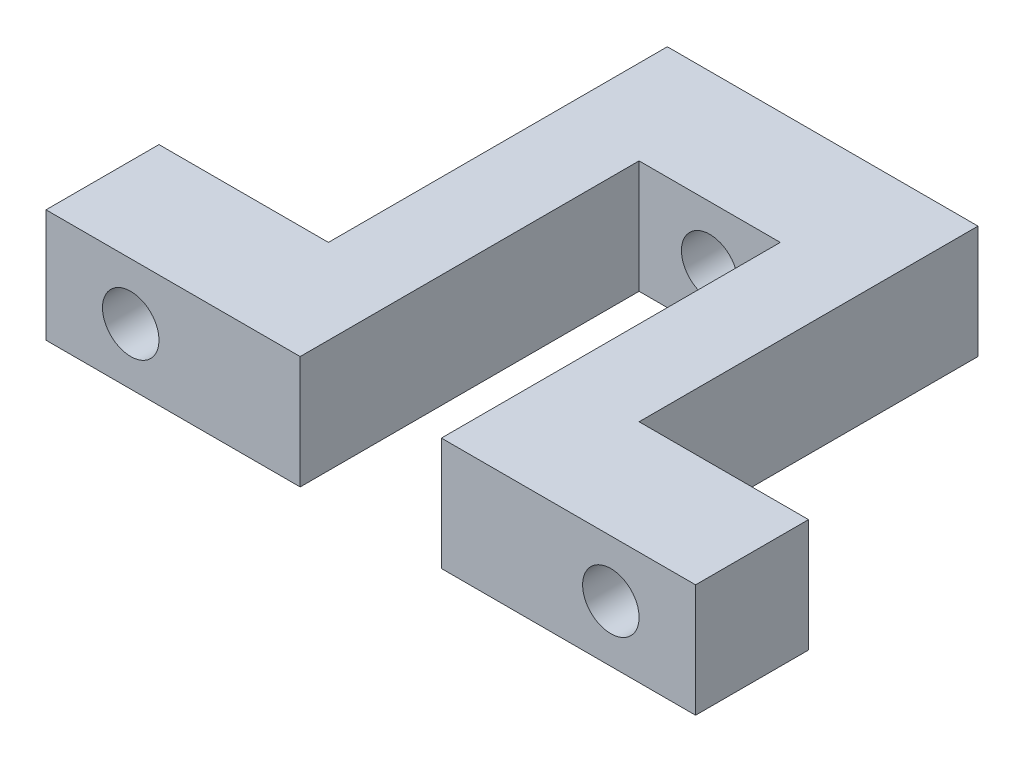
ISO-10303-21;
HEADER;
FILE_DESCRIPTION(('STEP AP214'),'2;1');
FILE_NAME('part.step','',(''),(''),'','','');
FILE_SCHEMA(('AUTOMOTIVE_DESIGN { 1 0 10303 214 1 1 1 1 }'));
ENDSEC;
DATA;
#1=APPLICATION_CONTEXT('core data for automotive mechanical design processes');
#2=APPLICATION_PROTOCOL_DEFINITION('international standard','automotive_design',2000,#1);
#3=PRODUCT_CONTEXT('',#1,'mechanical');
#4=PRODUCT('Part','Part','',(#3));
#5=PRODUCT_RELATED_PRODUCT_CATEGORY('part','',(#4));
#6=PRODUCT_DEFINITION_FORMATION('','',#4);
#7=PRODUCT_DEFINITION_CONTEXT('part definition',#1,'design');
#8=PRODUCT_DEFINITION('design','',#6,#7);
#9=PRODUCT_DEFINITION_SHAPE('','',#8);
#10=(LENGTH_UNIT() NAMED_UNIT(*) SI_UNIT(.MILLI.,.METRE.));
#11=(NAMED_UNIT(*) PLANE_ANGLE_UNIT() SI_UNIT($,.RADIAN.));
#12=(NAMED_UNIT(*) SI_UNIT($,.STERADIAN.) SOLID_ANGLE_UNIT());
#13=UNCERTAINTY_MEASURE_WITH_UNIT(LENGTH_MEASURE(1.E-05),#10,'distance_accuracy_value','');
#14=(GEOMETRIC_REPRESENTATION_CONTEXT(3) GLOBAL_UNCERTAINTY_ASSIGNED_CONTEXT((#13)) GLOBAL_UNIT_ASSIGNED_CONTEXT((#10,
#11,#12)) REPRESENTATION_CONTEXT('',''));
#15=CARTESIAN_POINT('',(0.,0.,0.));
#16=DIRECTION('',(0.,0.,1.));
#17=DIRECTION('',(1.,0.,0.));
#18=AXIS2_PLACEMENT_3D('',#15,#16,#17);
#19=CARTESIAN_POINT('',(-25.,20.,38.8484446347032));
#20=DIRECTION('',(0.,0.,-1.));
#21=DIRECTION('',(-1.,0.,0.));
#22=AXIS2_PLACEMENT_3D('',#19,#20,#21);
#23=PLANE('',#22);
#24=CARTESIAN_POINT('',(-55.,10.,38.8484446347032));
#25=DIRECTION('',(0.,0.,-1.));
#26=DIRECTION('',(-1.,0.,0.));
#27=AXIS2_PLACEMENT_3D('',#24,#25,#26);
#28=CIRCLE('',#27,4.99999999999999);
#29=CARTESIAN_POINT('',(-60.,10.,38.8484446347032));
#30=VERTEX_POINT('',#29);
#31=EDGE_CURVE('E261',#30,#30,#28,.T.);
#32=ORIENTED_EDGE('',*,*,#31,.T.);
#33=EDGE_LOOP('',(#32));
#34=FACE_BOUND('',#33,.T.);
#35=DIRECTION('',(1.,0.,0.));
#36=VECTOR('',#35,1.);
#37=CARTESIAN_POINT('',(-25.,0.,38.8484446347032));
#38=LINE('',#37,#36);
#39=CARTESIAN_POINT('',(-70.,0.,38.8484446347032));
#40=VERTEX_POINT('',#39);
#41=CARTESIAN_POINT('',(-25.,0.,38.8484446347032));
#42=VERTEX_POINT('',#41);
#43=EDGE_CURVE('E152',#40,#42,#38,.T.);
#44=ORIENTED_EDGE('',*,*,#43,.T.);
#45=DIRECTION('',(0.,-1.,0.));
#46=VECTOR('',#45,1.);
#47=CARTESIAN_POINT('',(-25.,20.,38.8484446347032));
#48=LINE('',#47,#46);
#49=CARTESIAN_POINT('',(-25.,20.,38.8484446347032));
#50=VERTEX_POINT('',#49);
#51=EDGE_CURVE('E11',#50,#42,#48,.T.);
#52=ORIENTED_EDGE('',*,*,#51,.F.);
#53=DIRECTION('',(1.,0.,0.));
#54=VECTOR('',#53,1.);
#55=CARTESIAN_POINT('',(-25.,20.,38.8484446347032));
#56=LINE('',#55,#54);
#57=CARTESIAN_POINT('',(-70.,20.,38.8484446347032));
#58=VERTEX_POINT('',#57);
#59=EDGE_CURVE('E175',#58,#50,#56,.T.);
#60=ORIENTED_EDGE('',*,*,#59,.F.);
#61=DIRECTION('',(0.,-1.,0.));
#62=VECTOR('',#61,1.);
#63=CARTESIAN_POINT('',(-70.,20.,38.8484446347032));
#64=LINE('',#63,#62);
#65=EDGE_CURVE('E148',#58,#40,#64,.T.);
#66=ORIENTED_EDGE('',*,*,#65,.T.);
#67=EDGE_LOOP('',(#44,#52,#60,#66));
#68=FACE_BOUND('',#67,.T.);
#69=ADVANCED_FACE('F32',(#34,#68),#23,.F.);
#70=CARTESIAN_POINT('',(-25.,20.,-21.1515553652968));
#71=DIRECTION('',(-1.,0.,0.));
#72=DIRECTION('',(0.,0.,1.));
#73=AXIS2_PLACEMENT_3D('',#70,#71,#72);
#74=PLANE('',#73);
#75=DIRECTION('',(0.,0.,-1.));
#76=VECTOR('',#75,1.);
#77=CARTESIAN_POINT('',(-25.,0.,-21.1515553652968));
#78=LINE('',#77,#76);
#79=CARTESIAN_POINT('',(-25.,0.,-21.1515553652968));
#80=VERTEX_POINT('',#79);
#81=EDGE_CURVE('E155',#42,#80,#78,.T.);
#82=ORIENTED_EDGE('',*,*,#81,.T.);
#83=DIRECTION('',(0.,-1.,0.));
#84=VECTOR('',#83,1.);
#85=CARTESIAN_POINT('',(-25.,20.,-21.1515553652968));
#86=LINE('',#85,#84);
#87=CARTESIAN_POINT('',(-25.,20.,-21.1515553652968));
#88=VERTEX_POINT('',#87);
#89=EDGE_CURVE('E40',#88,#80,#86,.T.);
#90=ORIENTED_EDGE('',*,*,#89,.F.);
#91=DIRECTION('',(0.,0.,-1.));
#92=VECTOR('',#91,1.);
#93=CARTESIAN_POINT('',(-25.,20.,-21.1515553652968));
#94=LINE('',#93,#92);
#95=EDGE_CURVE('E103',#50,#88,#94,.T.);
#96=ORIENTED_EDGE('',*,*,#95,.F.);
#97=ORIENTED_EDGE('',*,*,#51,.T.);
#98=EDGE_LOOP('',(#82,#90,#96,#97));
#99=FACE_BOUND('',#98,.T.);
#100=ADVANCED_FACE('F254',(#99),#74,.F.);
#101=CARTESIAN_POINT('',(0.,20.,-21.1515553652968));
#102=DIRECTION('',(0.,0.,-1.));
#103=DIRECTION('',(-1.,0.,0.));
#104=AXIS2_PLACEMENT_3D('',#101,#102,#103);
#105=PLANE('',#104);
#106=CARTESIAN_POINT('',(-12.5,10.,-21.1515553652968));
#107=DIRECTION('',(0.,0.,-1.));
#108=DIRECTION('',(-1.,0.,0.));
#109=AXIS2_PLACEMENT_3D('',#106,#107,#108);
#110=CIRCLE('',#109,4.99999999999999);
#111=CARTESIAN_POINT('',(-17.5,10.,-21.1515553652968));
#112=VERTEX_POINT('',#111);
#113=EDGE_CURVE('E156',#112,#112,#110,.T.);
#114=ORIENTED_EDGE('',*,*,#113,.T.);
#115=EDGE_LOOP('',(#114));
#116=FACE_BOUND('',#115,.T.);
#117=DIRECTION('',(1.,0.,0.));
#118=VECTOR('',#117,1.);
#119=CARTESIAN_POINT('',(0.,0.,-21.1515553652968));
#120=LINE('',#119,#118);
#121=CARTESIAN_POINT('',(0.,0.,-21.1515553652968));
#122=VERTEX_POINT('',#121);
#123=EDGE_CURVE('E158',#80,#122,#120,.T.);
#124=ORIENTED_EDGE('',*,*,#123,.T.);
#125=DIRECTION('',(0.,-1.,0.));
#126=VECTOR('',#125,1.);
#127=CARTESIAN_POINT('',(0.,20.,-21.1515553652968));
#128=LINE('',#127,#126);
#129=CARTESIAN_POINT('',(0.,20.,-21.1515553652968));
#130=VERTEX_POINT('',#129);
#131=EDGE_CURVE('E194',#130,#122,#128,.T.);
#132=ORIENTED_EDGE('',*,*,#131,.F.);
#133=DIRECTION('',(1.,0.,0.));
#134=VECTOR('',#133,1.);
#135=CARTESIAN_POINT('',(0.,20.,-21.1515553652968));
#136=LINE('',#135,#134);
#137=EDGE_CURVE('E202',#88,#130,#136,.T.);
#138=ORIENTED_EDGE('',*,*,#137,.F.);
#139=ORIENTED_EDGE('',*,*,#89,.T.);
#140=EDGE_LOOP('',(#124,#132,#138,#139));
#141=FACE_BOUND('',#140,.T.);
#142=ADVANCED_FACE('F200',(#116,#141),#105,.F.);
#143=CARTESIAN_POINT('',(0.,20.,38.8484446347032));
#144=DIRECTION('',(1.,0.,0.));
#145=DIRECTION('',(0.,0.,-1.));
#146=AXIS2_PLACEMENT_3D('',#143,#144,#145);
#147=PLANE('',#146);
#148=DIRECTION('',(0.,0.,1.));
#149=VECTOR('',#148,1.);
#150=CARTESIAN_POINT('',(0.,0.,38.8484446347032));
#151=LINE('',#150,#149);
#152=CARTESIAN_POINT('',(0.,0.,38.8484446347032));
#153=VERTEX_POINT('',#152);
#154=EDGE_CURVE('E160',#122,#153,#151,.T.);
#155=ORIENTED_EDGE('',*,*,#154,.T.);
#156=DIRECTION('',(0.,-1.,0.));
#157=VECTOR('',#156,1.);
#158=CARTESIAN_POINT('',(0.,20.,38.8484446347032));
#159=LINE('',#158,#157);
#160=CARTESIAN_POINT('',(0.,20.,38.8484446347032));
#161=VERTEX_POINT('',#160);
#162=EDGE_CURVE('E191',#161,#153,#159,.T.);
#163=ORIENTED_EDGE('',*,*,#162,.F.);
#164=DIRECTION('',(0.,0.,1.));
#165=VECTOR('',#164,1.);
#166=CARTESIAN_POINT('',(0.,20.,38.8484446347032));
#167=LINE('',#166,#165);
#168=EDGE_CURVE('E220',#130,#161,#167,.T.);
#169=ORIENTED_EDGE('',*,*,#168,.F.);
#170=ORIENTED_EDGE('',*,*,#131,.T.);
#171=EDGE_LOOP('',(#155,#163,#169,#170));
#172=FACE_BOUND('',#171,.T.);
#173=ADVANCED_FACE('F211',(#172),#147,.F.);
#174=CARTESIAN_POINT('',(45.,20.,38.8484446347032));
#175=DIRECTION('',(0.,0.,-1.));
#176=DIRECTION('',(-1.,0.,0.));
#177=AXIS2_PLACEMENT_3D('',#174,#175,#176);
#178=PLANE('',#177);
#179=CARTESIAN_POINT('',(30.,10.,38.8484446347032));
#180=DIRECTION('',(0.,0.,-1.));
#181=DIRECTION('',(-1.,0.,0.));
#182=AXIS2_PLACEMENT_3D('',#179,#180,#181);
#183=CIRCLE('',#182,4.99999999999999);
#184=CARTESIAN_POINT('',(25.,10.,38.8484446347032));
#185=VERTEX_POINT('',#184);
#186=EDGE_CURVE('E269',#185,#185,#183,.T.);
#187=ORIENTED_EDGE('',*,*,#186,.T.);
#188=EDGE_LOOP('',(#187));
#189=FACE_BOUND('',#188,.T.);
#190=DIRECTION('',(1.,0.,0.));
#191=VECTOR('',#190,1.);
#192=CARTESIAN_POINT('',(45.,0.,38.8484446347032));
#193=LINE('',#192,#191);
#194=CARTESIAN_POINT('',(45.,0.,38.8484446347032));
#195=VERTEX_POINT('',#194);
#196=EDGE_CURVE('E162',#153,#195,#193,.T.);
#197=ORIENTED_EDGE('',*,*,#196,.T.);
#198=DIRECTION('',(0.,-1.,0.));
#199=VECTOR('',#198,1.);
#200=CARTESIAN_POINT('',(45.,20.,38.8484446347032));
#201=LINE('',#200,#199);
#202=CARTESIAN_POINT('',(45.,20.,38.8484446347032));
#203=VERTEX_POINT('',#202);
#204=EDGE_CURVE('E188',#203,#195,#201,.T.);
#205=ORIENTED_EDGE('',*,*,#204,.F.);
#206=DIRECTION('',(1.,0.,0.));
#207=VECTOR('',#206,1.);
#208=CARTESIAN_POINT('',(45.,20.,38.8484446347032));
#209=LINE('',#208,#207);
#210=EDGE_CURVE('E217',#161,#203,#209,.T.);
#211=ORIENTED_EDGE('',*,*,#210,.F.);
#212=ORIENTED_EDGE('',*,*,#162,.T.);
#213=EDGE_LOOP('',(#197,#205,#211,#212));
#214=FACE_BOUND('',#213,.T.);
#215=ADVANCED_FACE('F215',(#189,#214),#178,.F.);
#216=CARTESIAN_POINT('',(45.,20.,18.8484446347032));
#217=DIRECTION('',(-1.,0.,0.));
#218=DIRECTION('',(0.,0.,1.));
#219=AXIS2_PLACEMENT_3D('',#216,#217,#218);
#220=PLANE('',#219);
#221=DIRECTION('',(0.,0.,-1.));
#222=VECTOR('',#221,1.);
#223=CARTESIAN_POINT('',(45.,0.,18.8484446347032));
#224=LINE('',#223,#222);
#225=CARTESIAN_POINT('',(45.,0.,18.8484446347032));
#226=VERTEX_POINT('',#225);
#227=EDGE_CURVE('E164',#195,#226,#224,.T.);
#228=ORIENTED_EDGE('',*,*,#227,.T.);
#229=DIRECTION('',(0.,-1.,0.));
#230=VECTOR('',#229,1.);
#231=CARTESIAN_POINT('',(45.,20.,18.8484446347032));
#232=LINE('',#231,#230);
#233=CARTESIAN_POINT('',(45.,20.,18.8484446347032));
#234=VERTEX_POINT('',#233);
#235=EDGE_CURVE('E185',#234,#226,#232,.T.);
#236=ORIENTED_EDGE('',*,*,#235,.F.);
#237=DIRECTION('',(0.,0.,-1.));
#238=VECTOR('',#237,1.);
#239=CARTESIAN_POINT('',(45.,20.,18.8484446347032));
#240=LINE('',#239,#238);
#241=EDGE_CURVE('E219',#203,#234,#240,.T.);
#242=ORIENTED_EDGE('',*,*,#241,.F.);
#243=ORIENTED_EDGE('',*,*,#204,.T.);
#244=EDGE_LOOP('',(#228,#236,#242,#243));
#245=FACE_BOUND('',#244,.T.);
#246=ADVANCED_FACE('F298',(#245),#220,.F.);
#247=CARTESIAN_POINT('',(15.,20.,18.8484446347032));
#248=DIRECTION('',(0.,0.,1.));
#249=DIRECTION('',(1.,0.,0.));
#250=AXIS2_PLACEMENT_3D('',#247,#248,#249);
#251=PLANE('',#250);
#252=CARTESIAN_POINT('',(30.,10.,18.8484446347032));
#253=DIRECTION('',(0.,0.,-1.));
#254=DIRECTION('',(-1.,0.,0.));
#255=AXIS2_PLACEMENT_3D('',#252,#253,#254);
#256=CIRCLE('',#255,4.99999999999999);
#257=CARTESIAN_POINT('',(25.,10.,18.8484446347032));
#258=VERTEX_POINT('',#257);
#259=EDGE_CURVE('E392',#258,#258,#256,.T.);
#260=ORIENTED_EDGE('',*,*,#259,.F.);
#261=EDGE_LOOP('',(#260));
#262=FACE_BOUND('',#261,.T.);
#263=DIRECTION('',(-1.,0.,0.));
#264=VECTOR('',#263,1.);
#265=CARTESIAN_POINT('',(15.,0.,18.8484446347032));
#266=LINE('',#265,#264);
#267=CARTESIAN_POINT('',(15.,0.,18.8484446347032));
#268=VERTEX_POINT('',#267);
#269=EDGE_CURVE('E166',#226,#268,#266,.T.);
#270=ORIENTED_EDGE('',*,*,#269,.T.);
#271=DIRECTION('',(0.,-1.,0.));
#272=VECTOR('',#271,1.);
#273=CARTESIAN_POINT('',(15.,20.,18.8484446347032));
#274=LINE('',#273,#272);
#275=CARTESIAN_POINT('',(15.,20.,18.8484446347032));
#276=VERTEX_POINT('',#275);
#277=EDGE_CURVE('E182',#276,#268,#274,.T.);
#278=ORIENTED_EDGE('',*,*,#277,.F.);
#279=DIRECTION('',(-1.,0.,0.));
#280=VECTOR('',#279,1.);
#281=CARTESIAN_POINT('',(15.,20.,18.8484446347032));
#282=LINE('',#281,#280);
#283=EDGE_CURVE('E222',#234,#276,#282,.T.);
#284=ORIENTED_EDGE('',*,*,#283,.F.);
#285=ORIENTED_EDGE('',*,*,#235,.T.);
#286=EDGE_LOOP('',(#270,#278,#284,#285));
#287=FACE_BOUND('',#286,.T.);
#288=ADVANCED_FACE('F293',(#262,#287),#251,.F.);
#289=CARTESIAN_POINT('',(15.,20.,-41.1515553652968));
#290=DIRECTION('',(-1.,0.,0.));
#291=DIRECTION('',(0.,0.,1.));
#292=AXIS2_PLACEMENT_3D('',#289,#290,#291);
#293=PLANE('',#292);
#294=DIRECTION('',(0.,0.,-1.));
#295=VECTOR('',#294,1.);
#296=CARTESIAN_POINT('',(15.,0.,-41.1515553652968));
#297=LINE('',#296,#295);
#298=CARTESIAN_POINT('',(15.,0.,-41.1515553652968));
#299=VERTEX_POINT('',#298);
#300=EDGE_CURVE('E168',#268,#299,#297,.T.);
#301=ORIENTED_EDGE('',*,*,#300,.T.);
#302=DIRECTION('',(0.,-1.,0.));
#303=VECTOR('',#302,1.);
#304=CARTESIAN_POINT('',(15.,20.,-41.1515553652968));
#305=LINE('',#304,#303);
#306=CARTESIAN_POINT('',(15.,20.,-41.1515553652968));
#307=VERTEX_POINT('',#306);
#308=EDGE_CURVE('E179',#307,#299,#305,.T.);
#309=ORIENTED_EDGE('',*,*,#308,.F.);
#310=DIRECTION('',(0.,0.,-1.));
#311=VECTOR('',#310,1.);
#312=CARTESIAN_POINT('',(15.,20.,-41.1515553652968));
#313=LINE('',#312,#311);
#314=EDGE_CURVE('E228',#276,#307,#313,.T.);
#315=ORIENTED_EDGE('',*,*,#314,.F.);
#316=ORIENTED_EDGE('',*,*,#277,.T.);
#317=EDGE_LOOP('',(#301,#309,#315,#316));
#318=FACE_BOUND('',#317,.T.);
#319=ADVANCED_FACE('F234',(#318),#293,.F.);
#320=CARTESIAN_POINT('',(-40.,20.,-41.1515553652968));
#321=DIRECTION('',(0.,0.,1.));
#322=DIRECTION('',(1.,0.,0.));
#323=AXIS2_PLACEMENT_3D('',#320,#321,#322);
#324=PLANE('',#323);
#325=CARTESIAN_POINT('',(-12.5,10.,-41.1515553652968));
#326=DIRECTION('',(0.,0.,-1.));
#327=DIRECTION('',(-1.,0.,0.));
#328=AXIS2_PLACEMENT_3D('',#325,#326,#327);
#329=CIRCLE('',#328,5.);
#330=CARTESIAN_POINT('',(-17.5,10.,-41.1515553652968));
#331=VERTEX_POINT('',#330);
#332=EDGE_CURVE('E263',#331,#331,#329,.T.);
#333=ORIENTED_EDGE('',*,*,#332,.F.);
#334=EDGE_LOOP('',(#333));
#335=FACE_BOUND('',#334,.T.);
#336=DIRECTION('',(-1.,0.,0.));
#337=VECTOR('',#336,1.);
#338=CARTESIAN_POINT('',(-40.,0.,-41.1515553652968));
#339=LINE('',#338,#337);
#340=CARTESIAN_POINT('',(-40.,0.,-41.1515553652968));
#341=VERTEX_POINT('',#340);
#342=EDGE_CURVE('E170',#299,#341,#339,.T.);
#343=ORIENTED_EDGE('',*,*,#342,.T.);
#344=DIRECTION('',(0.,-1.,0.));
#345=VECTOR('',#344,1.);
#346=CARTESIAN_POINT('',(-40.,20.,-41.1515553652968));
#347=LINE('',#346,#345);
#348=CARTESIAN_POINT('',(-40.,20.,-41.1515553652968));
#349=VERTEX_POINT('',#348);
#350=EDGE_CURVE('E143',#349,#341,#347,.T.);
#351=ORIENTED_EDGE('',*,*,#350,.F.);
#352=DIRECTION('',(-1.,0.,0.));
#353=VECTOR('',#352,1.);
#354=CARTESIAN_POINT('',(-40.,20.,-41.1515553652968));
#355=LINE('',#354,#353);
#356=EDGE_CURVE('E134',#307,#349,#355,.T.);
#357=ORIENTED_EDGE('',*,*,#356,.F.);
#358=ORIENTED_EDGE('',*,*,#308,.T.);
#359=EDGE_LOOP('',(#343,#351,#357,#358));
#360=FACE_BOUND('',#359,.T.);
#361=ADVANCED_FACE('F238',(#335,#360),#324,.F.);
#362=CARTESIAN_POINT('',(-40.,20.,18.8484446347032));
#363=DIRECTION('',(1.,0.,0.));
#364=DIRECTION('',(0.,0.,-1.));
#365=AXIS2_PLACEMENT_3D('',#362,#363,#364);
#366=PLANE('',#365);
#367=DIRECTION('',(0.,0.,1.));
#368=VECTOR('',#367,1.);
#369=CARTESIAN_POINT('',(-40.,0.,18.8484446347032));
#370=LINE('',#369,#368);
#371=CARTESIAN_POINT('',(-40.,0.,18.8484446347032));
#372=VERTEX_POINT('',#371);
#373=EDGE_CURVE('E142',#341,#372,#370,.T.);
#374=ORIENTED_EDGE('',*,*,#373,.T.);
#375=DIRECTION('',(0.,-1.,0.));
#376=VECTOR('',#375,1.);
#377=CARTESIAN_POINT('',(-40.,20.,18.8484446347032));
#378=LINE('',#377,#376);
#379=CARTESIAN_POINT('',(-40.,20.,18.8484446347032));
#380=VERTEX_POINT('',#379);
#381=EDGE_CURVE('E139',#380,#372,#378,.T.);
#382=ORIENTED_EDGE('',*,*,#381,.F.);
#383=DIRECTION('',(0.,0.,1.));
#384=VECTOR('',#383,1.);
#385=CARTESIAN_POINT('',(-40.,20.,18.8484446347032));
#386=LINE('',#385,#384);
#387=EDGE_CURVE('E128',#349,#380,#386,.T.);
#388=ORIENTED_EDGE('',*,*,#387,.F.);
#389=ORIENTED_EDGE('',*,*,#350,.T.);
#390=EDGE_LOOP('',(#374,#382,#388,#389));
#391=FACE_BOUND('',#390,.T.);
#392=ADVANCED_FACE('F140',(#391),#366,.F.);
#393=CARTESIAN_POINT('',(-70.,20.,18.8484446347032));
#394=DIRECTION('',(0.,0.,1.));
#395=DIRECTION('',(1.,0.,0.));
#396=AXIS2_PLACEMENT_3D('',#393,#394,#395);
#397=PLANE('',#396);
#398=CARTESIAN_POINT('',(-55.,10.,18.8484446347032));
#399=DIRECTION('',(0.,0.,-1.));
#400=DIRECTION('',(-1.,0.,0.));
#401=AXIS2_PLACEMENT_3D('',#398,#399,#400);
#402=CIRCLE('',#401,5.);
#403=CARTESIAN_POINT('',(-60.,10.,18.8484446347032));
#404=VERTEX_POINT('',#403);
#405=EDGE_CURVE('E264',#404,#404,#402,.T.);
#406=ORIENTED_EDGE('',*,*,#405,.F.);
#407=EDGE_LOOP('',(#406));
#408=FACE_BOUND('',#407,.T.);
#409=DIRECTION('',(-1.,0.,0.));
#410=VECTOR('',#409,1.);
#411=CARTESIAN_POINT('',(-70.,0.,18.8484446347032));
#412=LINE('',#411,#410);
#413=CARTESIAN_POINT('',(-70.,0.,18.8484446347032));
#414=VERTEX_POINT('',#413);
#415=EDGE_CURVE('E89',#372,#414,#412,.T.);
#416=ORIENTED_EDGE('',*,*,#415,.T.);
#417=DIRECTION('',(0.,-1.,0.));
#418=VECTOR('',#417,1.);
#419=CARTESIAN_POINT('',(-70.,20.,18.8484446347032));
#420=LINE('',#419,#418);
#421=CARTESIAN_POINT('',(-70.,20.,18.8484446347032));
#422=VERTEX_POINT('',#421);
#423=EDGE_CURVE('E144',#422,#414,#420,.T.);
#424=ORIENTED_EDGE('',*,*,#423,.F.);
#425=DIRECTION('',(-1.,0.,0.));
#426=VECTOR('',#425,1.);
#427=CARTESIAN_POINT('',(-70.,20.,18.8484446347032));
#428=LINE('',#427,#426);
#429=EDGE_CURVE('E132',#380,#422,#428,.T.);
#430=ORIENTED_EDGE('',*,*,#429,.F.);
#431=ORIENTED_EDGE('',*,*,#381,.T.);
#432=EDGE_LOOP('',(#416,#424,#430,#431));
#433=FACE_BOUND('',#432,.T.);
#434=ADVANCED_FACE('F146',(#408,#433),#397,.F.);
#435=CARTESIAN_POINT('',(-70.,20.,38.8484446347032));
#436=DIRECTION('',(1.,0.,0.));
#437=DIRECTION('',(0.,0.,-1.));
#438=AXIS2_PLACEMENT_3D('',#435,#436,#437);
#439=PLANE('',#438);
#440=DIRECTION('',(0.,0.,1.));
#441=VECTOR('',#440,1.);
#442=CARTESIAN_POINT('',(-70.,0.,38.8484446347032));
#443=LINE('',#442,#441);
#444=EDGE_CURVE('E95',#414,#40,#443,.T.);
#445=ORIENTED_EDGE('',*,*,#444,.T.);
#446=ORIENTED_EDGE('',*,*,#65,.F.);
#447=DIRECTION('',(0.,0.,1.));
#448=VECTOR('',#447,1.);
#449=CARTESIAN_POINT('',(-70.,20.,38.8484446347032));
#450=LINE('',#449,#448);
#451=EDGE_CURVE('E48',#422,#58,#450,.T.);
#452=ORIENTED_EDGE('',*,*,#451,.F.);
#453=ORIENTED_EDGE('',*,*,#423,.T.);
#454=EDGE_LOOP('',(#445,#446,#452,#453));
#455=FACE_BOUND('',#454,.T.);
#456=ADVANCED_FACE('F242',(#455),#439,.F.);
#457=CARTESIAN_POINT('',(0.,20.,0.));
#458=DIRECTION('',(0.,-1.,0.));
#459=DIRECTION('',(0.,0.,-1.));
#460=AXIS2_PLACEMENT_3D('',#457,#458,#459);
#461=PLANE('',#460);
#462=ORIENTED_EDGE('',*,*,#59,.T.);
#463=ORIENTED_EDGE('',*,*,#95,.T.);
#464=ORIENTED_EDGE('',*,*,#137,.T.);
#465=ORIENTED_EDGE('',*,*,#168,.T.);
#466=ORIENTED_EDGE('',*,*,#210,.T.);
#467=ORIENTED_EDGE('',*,*,#241,.T.);
#468=ORIENTED_EDGE('',*,*,#283,.T.);
#469=ORIENTED_EDGE('',*,*,#314,.T.);
#470=ORIENTED_EDGE('',*,*,#356,.T.);
#471=ORIENTED_EDGE('',*,*,#387,.T.);
#472=ORIENTED_EDGE('',*,*,#429,.T.);
#473=ORIENTED_EDGE('',*,*,#451,.T.);
#474=EDGE_LOOP('',(#462,#463,#464,#465,#466,#467,#468,#469,#470,#471,#472,#473));
#475=FACE_BOUND('',#474,.T.);
#476=ADVANCED_FACE('F130',(#475),#461,.F.);
#477=CARTESIAN_POINT('',(0.,0.,0.));
#478=DIRECTION('',(0.,-1.,0.));
#479=DIRECTION('',(0.,0.,-1.));
#480=AXIS2_PLACEMENT_3D('',#477,#478,#479);
#481=PLANE('',#480);
#482=ORIENTED_EDGE('',*,*,#43,.F.);
#483=ORIENTED_EDGE('',*,*,#444,.F.);
#484=ORIENTED_EDGE('',*,*,#415,.F.);
#485=ORIENTED_EDGE('',*,*,#373,.F.);
#486=ORIENTED_EDGE('',*,*,#342,.F.);
#487=ORIENTED_EDGE('',*,*,#300,.F.);
#488=ORIENTED_EDGE('',*,*,#269,.F.);
#489=ORIENTED_EDGE('',*,*,#227,.F.);
#490=ORIENTED_EDGE('',*,*,#196,.F.);
#491=ORIENTED_EDGE('',*,*,#154,.F.);
#492=ORIENTED_EDGE('',*,*,#123,.F.);
#493=ORIENTED_EDGE('',*,*,#81,.F.);
#494=EDGE_LOOP('',(#482,#483,#484,#485,#486,#487,#488,#489,#490,#491,#492,#493));
#495=FACE_BOUND('',#494,.T.);
#496=ADVANCED_FACE('F206',(#495),#481,.T.);
#497=CARTESIAN_POINT('',(-12.5,10.,-41.1515553652968));
#498=DIRECTION('',(0.,0.,-1.));
#499=DIRECTION('',(-1.,0.,0.));
#500=AXIS2_PLACEMENT_3D('',#497,#498,#499);
#501=CYLINDRICAL_SURFACE('',#500,5.);
#502=ORIENTED_EDGE('',*,*,#113,.F.);
#503=EDGE_LOOP('',(#502));
#504=FACE_BOUND('',#503,.T.);
#505=ORIENTED_EDGE('',*,*,#332,.T.);
#506=EDGE_LOOP('',(#505));
#507=FACE_BOUND('',#506,.T.);
#508=ADVANCED_FACE('F279',(#504,#507),#501,.F.);
#509=CARTESIAN_POINT('',(-55.,10.,18.8484446347032));
#510=DIRECTION('',(0.,0.,-1.));
#511=DIRECTION('',(-1.,0.,0.));
#512=AXIS2_PLACEMENT_3D('',#509,#510,#511);
#513=CYLINDRICAL_SURFACE('',#512,4.99999999999999);
#514=ORIENTED_EDGE('',*,*,#31,.F.);
#515=EDGE_LOOP('',(#514));
#516=FACE_BOUND('',#515,.T.);
#517=ORIENTED_EDGE('',*,*,#405,.T.);
#518=EDGE_LOOP('',(#517));
#519=FACE_BOUND('',#518,.T.);
#520=ADVANCED_FACE('F282',(#516,#519),#513,.F.);
#521=CARTESIAN_POINT('',(30.,10.,18.8484446347032));
#522=DIRECTION('',(0.,0.,-1.));
#523=DIRECTION('',(-1.,0.,0.));
#524=AXIS2_PLACEMENT_3D('',#521,#522,#523);
#525=CYLINDRICAL_SURFACE('',#524,4.99999999999999);
#526=ORIENTED_EDGE('',*,*,#186,.F.);
#527=EDGE_LOOP('',(#526));
#528=FACE_BOUND('',#527,.T.);
#529=ORIENTED_EDGE('',*,*,#259,.T.);
#530=EDGE_LOOP('',(#529));
#531=FACE_BOUND('',#530,.T.);
#532=ADVANCED_FACE('F371',(#528,#531),#525,.F.);
#533=CLOSED_SHELL('',(#69,#100,#142,#173,#215,#246,#288,#319,#361,#392,#434,#456,#476,#496,#508,
#520,#532));
#534=MANIFOLD_SOLID_BREP('B2',#533);
#535=ADVANCED_BREP_SHAPE_REPRESENTATION('',(#18,#534),#14);
#536=SHAPE_DEFINITION_REPRESENTATION(#9,#535);
ENDSEC;
END-ISO-10303-21;
